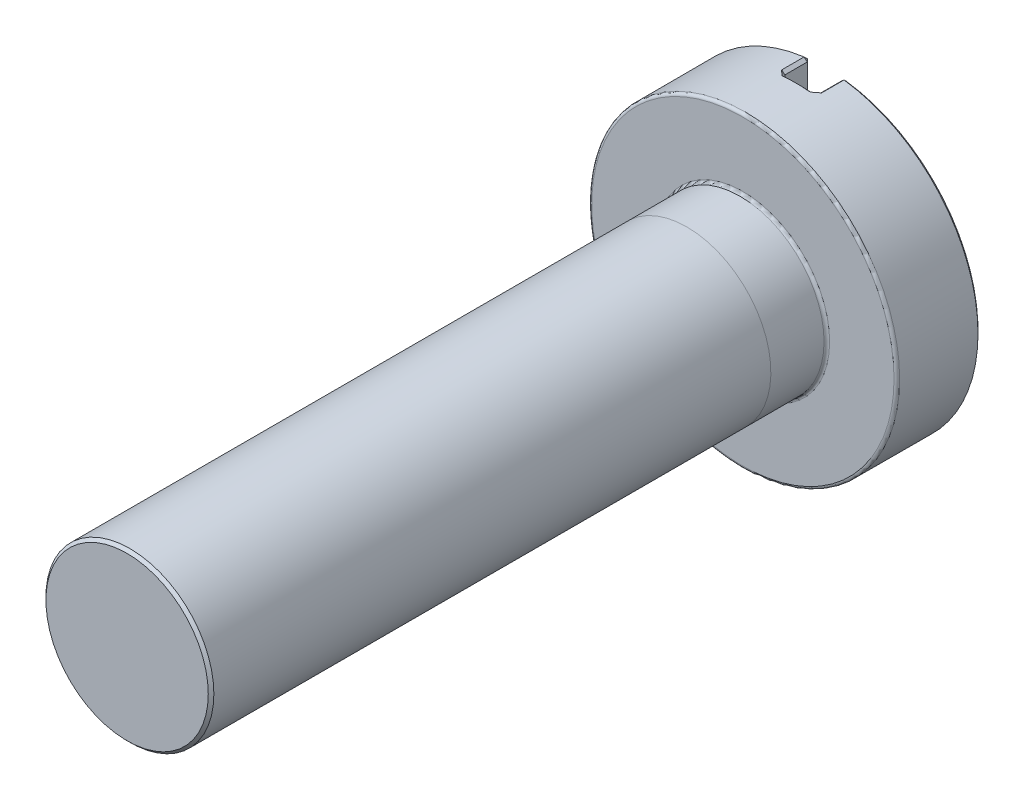
ISO-10303-21;
HEADER;
FILE_DESCRIPTION(('STEP AP214'),'2;1');
FILE_NAME('part.step','',(''),(''),'','','');
FILE_SCHEMA(('AUTOMOTIVE_DESIGN { 1 0 10303 214 1 1 1 1 }'));
ENDSEC;
DATA;
#1=APPLICATION_CONTEXT('core data for automotive mechanical design processes');
#2=APPLICATION_PROTOCOL_DEFINITION('international standard','automotive_design',2000,#1);
#3=PRODUCT_CONTEXT('',#1,'mechanical');
#4=PRODUCT('Part','Part','',(#3));
#5=PRODUCT_RELATED_PRODUCT_CATEGORY('part','',(#4));
#6=PRODUCT_DEFINITION_FORMATION('','',#4);
#7=PRODUCT_DEFINITION_CONTEXT('part definition',#1,'design');
#8=PRODUCT_DEFINITION('design','',#6,#7);
#9=PRODUCT_DEFINITION_SHAPE('','',#8);
#10=(LENGTH_UNIT() NAMED_UNIT(*) SI_UNIT(.MILLI.,.METRE.));
#11=(NAMED_UNIT(*) PLANE_ANGLE_UNIT() SI_UNIT($,.RADIAN.));
#12=(NAMED_UNIT(*) SI_UNIT($,.STERADIAN.) SOLID_ANGLE_UNIT());
#13=UNCERTAINTY_MEASURE_WITH_UNIT(LENGTH_MEASURE(1.E-05),#10,'distance_accuracy_value','');
#14=(GEOMETRIC_REPRESENTATION_CONTEXT(3) GLOBAL_UNCERTAINTY_ASSIGNED_CONTEXT((#13)) GLOBAL_UNIT_ASSIGNED_CONTEXT((#10,
#11,#12)) REPRESENTATION_CONTEXT('',''));
#15=CARTESIAN_POINT('',(0.,0.,0.));
#16=DIRECTION('',(0.,0.,1.));
#17=DIRECTION('',(1.,0.,0.));
#18=AXIS2_PLACEMENT_3D('',#15,#16,#17);
#19=CARTESIAN_POINT('',(0.,0.,11.));
#20=DIRECTION('',(0.,0.,-1.));
#21=DIRECTION('',(-1.,0.,0.));
#22=AXIS2_PLACEMENT_3D('',#19,#20,#21);
#23=CYLINDRICAL_SURFACE('',#22,1.5);
#24=CARTESIAN_POINT('',(0.,0.,10.95));
#25=DIRECTION('',(0.,0.,1.));
#26=DIRECTION('',(1.,0.,0.));
#27=AXIS2_PLACEMENT_3D('',#24,#25,#26);
#28=CIRCLE('',#27,1.5);
#29=CARTESIAN_POINT('',(1.5,0.,10.95));
#30=VERTEX_POINT('',#29);
#31=EDGE_CURVE('E49',#30,#30,#28,.F.);
#32=ORIENTED_EDGE('',*,*,#31,.T.);
#33=EDGE_LOOP('',(#32));
#34=FACE_BOUND('',#33,.T.);
#35=CARTESIAN_POINT('',(0.,0.,0.999999999999999));
#36=DIRECTION('',(0.,0.,-1.));
#37=DIRECTION('',(0.,1.,0.));
#38=AXIS2_PLACEMENT_3D('',#35,#36,#37);
#39=CIRCLE('',#38,1.5);
#40=CARTESIAN_POINT('',(0.,1.5,0.999999999999999));
#41=VERTEX_POINT('',#40);
#42=EDGE_CURVE('E11',#41,#41,#39,.T.);
#43=ORIENTED_EDGE('',*,*,#42,.F.);
#44=EDGE_LOOP('',(#43));
#45=FACE_BOUND('',#44,.T.);
#46=ADVANCED_FACE('F39',(#34,#45),#23,.T.);
#47=CARTESIAN_POINT('',(0.,0.,-1.5));
#48=DIRECTION('',(0.,0.,1.));
#49=DIRECTION('',(1.,0.,0.));
#50=AXIS2_PLACEMENT_3D('',#47,#48,#49);
#51=CYLINDRICAL_SURFACE('',#50,2.75);
#52=CARTESIAN_POINT('',(0.,0.,-0.0499999999999999));
#53=DIRECTION('',(0.,0.,1.));
#54=DIRECTION('',(1.,0.,0.));
#55=AXIS2_PLACEMENT_3D('',#52,#53,#54);
#56=CIRCLE('',#55,2.75);
#57=CARTESIAN_POINT('',(2.75,0.,-0.0499999999999999));
#58=VERTEX_POINT('',#57);
#59=EDGE_CURVE('E506',#58,#58,#56,.F.);
#60=ORIENTED_EDGE('',*,*,#59,.T.);
#61=EDGE_LOOP('',(#60));
#62=FACE_BOUND('',#61,.T.);
#63=CARTESIAN_POINT('',(0.356481481481481,-2.72679683023154,-1.05));
#64=CARTESIAN_POINT('',(0.347664395842464,-2.72794946380014,-1.04117807206455));
#65=CARTESIAN_POINT('',(0.33882512364023,-2.7290615860206,-1.03237298581949));
#66=CARTESIAN_POINT('',(0.321099028338335,-2.73120398569254,-1.01480079977808));
#67=CARTESIAN_POINT('',(0.312212205212935,-2.73223426309969,-1.0060337000023));
#68=CARTESIAN_POINT('',(0.287162841256096,-2.73501387422917,-0.981451563587695));
#69=CARTESIAN_POINT('',(0.270942516358508,-2.73666902458202,-0.965684718089822));
#70=CARTESIAN_POINT('',(0.254629629631047,-2.7381862156752,-0.950000000001396));
#71=B_SPLINE_CURVE_WITH_KNOTS('',3,(#63,#64,#65,#66,#67,#68,#69,#70),.UNSPECIFIED.,.F.,.F.,(4,2,
2,4),(0.,0.0375773794297737,0.0751547792021278,0.1431957218944),.UNSPECIFIED.);
#72=CARTESIAN_POINT('',(0.356481481481481,-2.72679683023154,-1.05));
#73=VERTEX_POINT('',#72);
#74=CARTESIAN_POINT('',(0.254629629629628,-2.73818621567538,-0.95));
#75=VERTEX_POINT('',#74);
#76=EDGE_CURVE('E251',#73,#75,#71,.T.);
#77=ORIENTED_EDGE('',*,*,#76,.F.);
#78=DIRECTION('',(0.,0.,1.));
#79=VECTOR('',#78,1.);
#80=CARTESIAN_POINT('',(0.356481481481481,-2.72679683023154,-1.5));
#81=LINE('',#80,#79);
#82=CARTESIAN_POINT('',(0.356481481481481,-2.72679683023154,-1.45));
#83=VERTEX_POINT('',#82);
#84=EDGE_CURVE('E249',#73,#83,#81,.F.);
#85=ORIENTED_EDGE('',*,*,#84,.T.);
#86=CARTESIAN_POINT('',(0.,0.,-1.45));
#87=DIRECTION('',(0.,0.,1.));
#88=DIRECTION('',(1.,0.,0.));
#89=AXIS2_PLACEMENT_3D('',#86,#87,#88);
#90=CIRCLE('',#89,2.75);
#91=CARTESIAN_POINT('',(0.356481481481483,2.72679683023154,-1.45));
#92=VERTEX_POINT('',#91);
#93=EDGE_CURVE('E245',#83,#92,#90,.T.);
#94=ORIENTED_EDGE('',*,*,#93,.T.);
#95=DIRECTION('',(0.,0.,1.));
#96=VECTOR('',#95,1.);
#97=CARTESIAN_POINT('',(0.356481481481483,2.72679683023154,-1.5));
#98=LINE('',#97,#96);
#99=CARTESIAN_POINT('',(0.356481481481483,2.72679683023154,-1.05));
#100=VERTEX_POINT('',#99);
#101=EDGE_CURVE('E236',#92,#100,#98,.T.);
#102=ORIENTED_EDGE('',*,*,#101,.T.);
#103=CARTESIAN_POINT('',(0.254629629629628,2.73818621567538,-0.95));
#104=CARTESIAN_POINT('',(0.263638943794522,2.73734837041017,-0.958661912495163));
#105=CARTESIAN_POINT('',(0.272619899169562,2.73646840241964,-0.967349125297718));
#106=CARTESIAN_POINT('',(0.290528422567071,2.73462508679492,-0.984769605017457));
#107=CARTESIAN_POINT('',(0.299455990634111,2.73366173923036,-0.99350287189618));
#108=CARTESIAN_POINT('',(0.324478250116621,2.7308381100455,-1.01810769091684));
#109=CARTESIAN_POINT('',(0.340515929031503,2.728883819563,-1.034026548804));
#110=CARTESIAN_POINT('',(0.356481481481483,2.72679683023154,-1.05));
#111=B_SPLINE_CURVE_WITH_KNOTS('',3,(#103,#104,#105,#106,#107,#108,#109,#110),.UNSPECIFIED.,.F.,
.F.,(4,2,2,4),(0.,0.0375774596881583,0.0751548880003336,0.143195791124041),.UNSPECIFIED.);
#112=CARTESIAN_POINT('',(0.254629629629628,2.73818621567538,-0.95));
#113=VERTEX_POINT('',#112);
#114=EDGE_CURVE('E229',#113,#100,#111,.T.);
#115=ORIENTED_EDGE('',*,*,#114,.F.);
#116=CARTESIAN_POINT('',(0.,0.,-0.95));
#117=DIRECTION('',(0.,0.,-1.));
#118=DIRECTION('',(-1.,0.,0.));
#119=AXIS2_PLACEMENT_3D('',#116,#117,#118);
#120=CIRCLE('',#119,2.75);
#121=CARTESIAN_POINT('',(-0.254629629629628,2.73818621567538,-0.95));
#122=VERTEX_POINT('',#121);
#123=EDGE_CURVE('E192',#113,#122,#120,.F.);
#124=ORIENTED_EDGE('',*,*,#123,.T.);
#125=CARTESIAN_POINT('',(-0.356481481481481,2.72679683023154,-1.05));
#126=CARTESIAN_POINT('',(-0.347664395842464,2.72794946380014,-1.04117807206455));
#127=CARTESIAN_POINT('',(-0.33882512364023,2.7290615860206,-1.03237298581949));
#128=CARTESIAN_POINT('',(-0.321099028338336,2.73120398569254,-1.01480079977808));
#129=CARTESIAN_POINT('',(-0.312212205212935,2.73223426309969,-1.0060337000023));
#130=CARTESIAN_POINT('',(-0.287162841256096,2.73501387422917,-0.981451563587695));
#131=CARTESIAN_POINT('',(-0.270942516358508,2.73666902458202,-0.965684718089822));
#132=CARTESIAN_POINT('',(-0.254629629631047,2.7381862156752,-0.950000000001396));
#133=B_SPLINE_CURVE_WITH_KNOTS('',3,(#125,#126,#127,#128,#129,#130,#131,#132),.UNSPECIFIED.,.F.,
.F.,(4,2,2,4),(0.,0.0375773794297736,0.0751547792021278,0.1431957218944),.UNSPECIFIED.);
#134=CARTESIAN_POINT('',(-0.356481481481481,2.72679683023154,-1.05));
#135=VERTEX_POINT('',#134);
#136=EDGE_CURVE('E183',#135,#122,#133,.T.);
#137=ORIENTED_EDGE('',*,*,#136,.F.);
#138=DIRECTION('',(0.,0.,1.));
#139=VECTOR('',#138,1.);
#140=CARTESIAN_POINT('',(-0.356481481481481,2.72679683023154,-1.5));
#141=LINE('',#140,#139);
#142=CARTESIAN_POINT('',(-0.356481481481481,2.72679683023154,-1.45));
#143=VERTEX_POINT('',#142);
#144=EDGE_CURVE('E180',#135,#143,#141,.F.);
#145=ORIENTED_EDGE('',*,*,#144,.T.);
#146=CARTESIAN_POINT('',(0.,0.,-1.45));
#147=DIRECTION('',(0.,0.,1.));
#148=DIRECTION('',(1.,0.,0.));
#149=AXIS2_PLACEMENT_3D('',#146,#147,#148);
#150=CIRCLE('',#149,2.75);
#151=CARTESIAN_POINT('',(-0.356481481481481,-2.72679683023154,-1.45));
#152=VERTEX_POINT('',#151);
#153=EDGE_CURVE('E175',#143,#152,#150,.T.);
#154=ORIENTED_EDGE('',*,*,#153,.T.);
#155=DIRECTION('',(0.,0.,1.));
#156=VECTOR('',#155,1.);
#157=CARTESIAN_POINT('',(-0.356481481481481,-2.72679683023154,-1.5));
#158=LINE('',#157,#156);
#159=CARTESIAN_POINT('',(-0.356481481481481,-2.72679683023154,-1.05));
#160=VERTEX_POINT('',#159);
#161=EDGE_CURVE('E150',#152,#160,#158,.T.);
#162=ORIENTED_EDGE('',*,*,#161,.T.);
#163=CARTESIAN_POINT('',(-0.254629629629628,-2.73818621567538,-0.95));
#164=CARTESIAN_POINT('',(-0.263638943794522,-2.73734837041017,-0.958661912495163));
#165=CARTESIAN_POINT('',(-0.272619899169562,-2.73646840241964,-0.967349125297718));
#166=CARTESIAN_POINT('',(-0.290528422567071,-2.73462508679492,-0.984769605017457));
#167=CARTESIAN_POINT('',(-0.299455990634111,-2.73366173923036,-0.993502871896181));
#168=CARTESIAN_POINT('',(-0.324478250116621,-2.7308381100455,-1.01810769091684));
#169=CARTESIAN_POINT('',(-0.340515929031502,-2.728883819563,-1.034026548804));
#170=CARTESIAN_POINT('',(-0.356481481481481,-2.72679683023154,-1.05));
#171=B_SPLINE_CURVE_WITH_KNOTS('',3,(#163,#164,#165,#166,#167,#168,#169,#170),.UNSPECIFIED.,.F.,
.F.,(4,2,2,4),(0.,0.0375774596881584,0.075154888000334,0.14319579112404),.UNSPECIFIED.);
#172=CARTESIAN_POINT('',(-0.254629629629628,-2.73818621567538,-0.95));
#173=VERTEX_POINT('',#172);
#174=EDGE_CURVE('E238',#173,#160,#171,.T.);
#175=ORIENTED_EDGE('',*,*,#174,.F.);
#176=CARTESIAN_POINT('',(0.,0.,-0.95));
#177=DIRECTION('',(0.,0.,-1.));
#178=DIRECTION('',(-1.,0.,0.));
#179=AXIS2_PLACEMENT_3D('',#176,#177,#178);
#180=CIRCLE('',#179,2.75);
#181=EDGE_CURVE('E247',#173,#75,#180,.F.);
#182=ORIENTED_EDGE('',*,*,#181,.T.);
#183=EDGE_LOOP('',(#77,#85,#94,#102,#115,#124,#137,#145,#154,#162,#175,#182));
#184=FACE_BOUND('',#183,.T.);
#185=ADVANCED_FACE('F194',(#62,#184),#51,.T.);
#186=CARTESIAN_POINT('',(0.,0.,-1.5));
#187=DIRECTION('',(0.,0.,1.));
#188=DIRECTION('',(1.,0.,0.));
#189=AXIS2_PLACEMENT_3D('',#186,#187,#188);
#190=PLANE('',#189);
#191=CARTESIAN_POINT('',(0.,0.,-1.5));
#192=DIRECTION('',(0.,0.,1.));
#193=DIRECTION('',(1.,0.,0.));
#194=AXIS2_PLACEMENT_3D('',#191,#192,#193);
#195=CIRCLE('',#194,2.7);
#196=CARTESIAN_POINT('',(0.35,2.67721870604551,-1.5));
#197=VERTEX_POINT('',#196);
#198=CARTESIAN_POINT('',(0.35,-2.67721870604551,-1.5));
#199=VERTEX_POINT('',#198);
#200=EDGE_CURVE('E551',#197,#199,#195,.F.);
#201=ORIENTED_EDGE('',*,*,#200,.T.);
#202=DIRECTION('',(0.,1.,0.));
#203=VECTOR('',#202,1.);
#204=CARTESIAN_POINT('',(0.35,0.,-1.5));
#205=LINE('',#204,#203);
#206=EDGE_CURVE('E595',#199,#197,#205,.T.);
#207=ORIENTED_EDGE('',*,*,#206,.T.);
#208=EDGE_LOOP('',(#201,#207));
#209=FACE_BOUND('',#208,.T.);
#210=ADVANCED_FACE('F485',(#209),#190,.F.);
#211=ORIENTED_EDGE('',*,*,#42,.T.);
#212=EDGE_LOOP('',(#211));
#213=FACE_BOUND('',#212,.T.);
#214=CARTESIAN_POINT('',(0.,0.,0.0499999999999997));
#215=DIRECTION('',(0.,0.,1.));
#216=DIRECTION('',(1.,0.,0.));
#217=AXIS2_PLACEMENT_3D('',#214,#215,#216);
#218=CIRCLE('',#217,1.5);
#219=CARTESIAN_POINT('',(1.5,0.,0.0499999999999997));
#220=VERTEX_POINT('',#219);
#221=EDGE_CURVE('E504',#220,#220,#218,.T.);
#222=ORIENTED_EDGE('',*,*,#221,.T.);
#223=EDGE_LOOP('',(#222));
#224=FACE_BOUND('',#223,.T.);
#225=ADVANCED_FACE('F207',(#213,#224),#23,.T.);
#226=CARTESIAN_POINT('',(0.,0.,11.));
#227=DIRECTION('',(0.,0.,1.));
#228=DIRECTION('',(1.,0.,0.));
#229=AXIS2_PLACEMENT_3D('',#226,#227,#228);
#230=PLANE('',#229);
#231=CARTESIAN_POINT('',(0.,0.,11.));
#232=DIRECTION('',(0.,0.,1.));
#233=DIRECTION('',(1.,0.,0.));
#234=AXIS2_PLACEMENT_3D('',#231,#232,#233);
#235=CIRCLE('',#234,1.45);
#236=CARTESIAN_POINT('',(1.45,0.,11.));
#237=VERTEX_POINT('',#236);
#238=EDGE_CURVE('E505',#237,#237,#235,.T.);
#239=ORIENTED_EDGE('',*,*,#238,.T.);
#240=EDGE_LOOP('',(#239));
#241=FACE_BOUND('',#240,.T.);
#242=ADVANCED_FACE('F490',(#241),#230,.T.);
#243=CARTESIAN_POINT('',(0.,0.,-1.5));
#244=DIRECTION('',(0.,0.,1.));
#245=DIRECTION('',(1.,0.,0.));
#246=AXIS2_PLACEMENT_3D('',#243,#244,#245);
#247=CIRCLE('',#246,2.7);
#248=CARTESIAN_POINT('',(-0.35,-2.67721870604551,-1.5));
#249=VERTEX_POINT('',#248);
#250=CARTESIAN_POINT('',(-0.35,2.67721870604551,-1.5));
#251=VERTEX_POINT('',#250);
#252=EDGE_CURVE('E55',#249,#251,#247,.F.);
#253=ORIENTED_EDGE('',*,*,#252,.T.);
#254=DIRECTION('',(0.,-1.,0.));
#255=VECTOR('',#254,1.);
#256=CARTESIAN_POINT('',(-0.35,0.,-1.5));
#257=LINE('',#256,#255);
#258=EDGE_CURVE('E522',#251,#249,#257,.T.);
#259=ORIENTED_EDGE('',*,*,#258,.T.);
#260=EDGE_LOOP('',(#253,#259));
#261=FACE_BOUND('',#260,.T.);
#262=ADVANCED_FACE('F496',(#261),#190,.F.);
#263=CARTESIAN_POINT('',(0.,0.,0.));
#264=DIRECTION('',(0.,0.,1.));
#265=DIRECTION('',(1.,0.,0.));
#266=AXIS2_PLACEMENT_3D('',#263,#264,#265);
#267=PLANE('',#266);
#268=CARTESIAN_POINT('',(0.,0.,0.));
#269=DIRECTION('',(0.,0.,1.));
#270=DIRECTION('',(1.,0.,0.));
#271=AXIS2_PLACEMENT_3D('',#268,#269,#270);
#272=CIRCLE('',#271,2.7);
#273=CARTESIAN_POINT('',(2.7,0.,0.));
#274=VERTEX_POINT('',#273);
#275=EDGE_CURVE('E511',#274,#274,#272,.T.);
#276=ORIENTED_EDGE('',*,*,#275,.T.);
#277=EDGE_LOOP('',(#276));
#278=FACE_BOUND('',#277,.T.);
#279=CARTESIAN_POINT('',(0.,0.,0.));
#280=DIRECTION('',(0.,0.,1.));
#281=DIRECTION('',(1.,0.,0.));
#282=AXIS2_PLACEMENT_3D('',#279,#280,#281);
#283=CIRCLE('',#282,1.55);
#284=CARTESIAN_POINT('',(1.55,0.,0.));
#285=VERTEX_POINT('',#284);
#286=EDGE_CURVE('E519',#285,#285,#283,.F.);
#287=ORIENTED_EDGE('',*,*,#286,.T.);
#288=EDGE_LOOP('',(#287));
#289=FACE_BOUND('',#288,.T.);
#290=ADVANCED_FACE('F610',(#278,#289),#267,.T.);
#291=CARTESIAN_POINT('',(0.3,-5.11751622539691,-1.));
#292=DIRECTION('',(1.,0.,0.));
#293=DIRECTION('',(0.,0.,-1.));
#294=AXIS2_PLACEMENT_3D('',#291,#292,#293);
#295=PLANE('',#294);
#296=DIRECTION('',(0.,0.,1.));
#297=VECTOR('',#296,1.);
#298=CARTESIAN_POINT('',(0.3,-2.67721870604551,-1.));
#299=LINE('',#298,#297);
#300=CARTESIAN_POINT('',(0.3,-2.67721870604551,-1.45));
#301=VERTEX_POINT('',#300);
#302=CARTESIAN_POINT('',(0.3,-2.67721870604551,-1.05));
#303=VERTEX_POINT('',#302);
#304=EDGE_CURVE('E547',#301,#303,#299,.T.);
#305=ORIENTED_EDGE('',*,*,#304,.T.);
#306=DIRECTION('',(0.,1.,0.));
#307=VECTOR('',#306,1.);
#308=CARTESIAN_POINT('',(0.3,-5.11751622539691,-1.05));
#309=LINE('',#308,#307);
#310=CARTESIAN_POINT('',(0.3,2.67721870604551,-1.05));
#311=VERTEX_POINT('',#310);
#312=EDGE_CURVE('E865',#303,#311,#309,.T.);
#313=ORIENTED_EDGE('',*,*,#312,.T.);
#314=DIRECTION('',(0.,0.,-1.));
#315=VECTOR('',#314,1.);
#316=CARTESIAN_POINT('',(0.3,2.67721870604551,-1.5));
#317=LINE('',#316,#315);
#318=CARTESIAN_POINT('',(0.3,2.67721870604551,-1.45));
#319=VERTEX_POINT('',#318);
#320=EDGE_CURVE('E868',#311,#319,#317,.T.);
#321=ORIENTED_EDGE('',*,*,#320,.T.);
#322=DIRECTION('',(0.,-1.,0.));
#323=VECTOR('',#322,1.);
#324=CARTESIAN_POINT('',(0.3,-5.11751622539691,-1.45));
#325=LINE('',#324,#323);
#326=EDGE_CURVE('E258',#319,#301,#325,.T.);
#327=ORIENTED_EDGE('',*,*,#326,.T.);
#328=EDGE_LOOP('',(#305,#313,#321,#327));
#329=FACE_BOUND('',#328,.T.);
#330=ADVANCED_FACE('F614',(#329),#295,.F.);
#331=CARTESIAN_POINT('',(-0.3,-5.11751622539691,-1.));
#332=DIRECTION('',(-1.,0.,0.));
#333=DIRECTION('',(0.,0.,1.));
#334=AXIS2_PLACEMENT_3D('',#331,#332,#333);
#335=PLANE('',#334);
#336=DIRECTION('',(0.,0.,1.));
#337=VECTOR('',#336,1.);
#338=CARTESIAN_POINT('',(-0.3,2.67721870604551,-1.));
#339=LINE('',#338,#337);
#340=CARTESIAN_POINT('',(-0.3,2.67721870604551,-1.45));
#341=VERTEX_POINT('',#340);
#342=CARTESIAN_POINT('',(-0.3,2.67721870604551,-1.05));
#343=VERTEX_POINT('',#342);
#344=EDGE_CURVE('E167',#341,#343,#339,.T.);
#345=ORIENTED_EDGE('',*,*,#344,.T.);
#346=DIRECTION('',(0.,-1.,0.));
#347=VECTOR('',#346,1.);
#348=CARTESIAN_POINT('',(-0.3,-5.11751622539691,-1.05));
#349=LINE('',#348,#347);
#350=CARTESIAN_POINT('',(-0.3,-2.67721870604551,-1.05));
#351=VERTEX_POINT('',#350);
#352=EDGE_CURVE('E172',#343,#351,#349,.T.);
#353=ORIENTED_EDGE('',*,*,#352,.T.);
#354=DIRECTION('',(0.,0.,-1.));
#355=VECTOR('',#354,1.);
#356=CARTESIAN_POINT('',(-0.3,-2.67721870604551,-1.5));
#357=LINE('',#356,#355);
#358=CARTESIAN_POINT('',(-0.3,-2.67721870604551,-1.45));
#359=VERTEX_POINT('',#358);
#360=EDGE_CURVE('E148',#351,#359,#357,.T.);
#361=ORIENTED_EDGE('',*,*,#360,.T.);
#362=DIRECTION('',(0.,1.,0.));
#363=VECTOR('',#362,1.);
#364=CARTESIAN_POINT('',(-0.3,-5.11751622539691,-1.45));
#365=LINE('',#364,#363);
#366=EDGE_CURVE('E161',#359,#341,#365,.T.);
#367=ORIENTED_EDGE('',*,*,#366,.T.);
#368=EDGE_LOOP('',(#345,#353,#361,#367));
#369=FACE_BOUND('',#368,.T.);
#370=ADVANCED_FACE('F170',(#369),#335,.F.);
#371=CARTESIAN_POINT('',(0.,0.,-1.));
#372=DIRECTION('',(0.,0.,-1.));
#373=DIRECTION('',(-1.,0.,0.));
#374=AXIS2_PLACEMENT_3D('',#371,#372,#373);
#375=PLANE('',#374);
#376=DIRECTION('',(0.,-1.,0.));
#377=VECTOR('',#376,1.);
#378=CARTESIAN_POINT('',(0.249999999999999,0.,-1.));
#379=LINE('',#378,#377);
#380=CARTESIAN_POINT('',(0.249999999999998,2.68840101175401,-1.));
#381=VERTEX_POINT('',#380);
#382=CARTESIAN_POINT('',(0.249999999999999,-2.68840101175401,-1.));
#383=VERTEX_POINT('',#382);
#384=EDGE_CURVE('E586',#381,#383,#379,.T.);
#385=ORIENTED_EDGE('',*,*,#384,.T.);
#386=CARTESIAN_POINT('',(0.,0.,-1.));
#387=DIRECTION('',(0.,0.,-1.));
#388=DIRECTION('',(-1.,0.,0.));
#389=AXIS2_PLACEMENT_3D('',#386,#387,#388);
#390=CIRCLE('',#389,2.7);
#391=CARTESIAN_POINT('',(-0.249999999999999,-2.68840101175401,-1.));
#392=VERTEX_POINT('',#391);
#393=EDGE_CURVE('E565',#383,#392,#390,.T.);
#394=ORIENTED_EDGE('',*,*,#393,.T.);
#395=DIRECTION('',(0.,1.,0.));
#396=VECTOR('',#395,1.);
#397=CARTESIAN_POINT('',(-0.249999999999999,0.,-1.));
#398=LINE('',#397,#396);
#399=CARTESIAN_POINT('',(-0.249999999999999,2.68840101175401,-1.));
#400=VERTEX_POINT('',#399);
#401=EDGE_CURVE('E590',#392,#400,#398,.T.);
#402=ORIENTED_EDGE('',*,*,#401,.T.);
#403=CARTESIAN_POINT('',(0.,0.,-1.));
#404=DIRECTION('',(0.,0.,-1.));
#405=DIRECTION('',(-1.,0.,0.));
#406=AXIS2_PLACEMENT_3D('',#403,#404,#405);
#407=CIRCLE('',#406,2.7);
#408=EDGE_CURVE('E583',#400,#381,#407,.T.);
#409=ORIENTED_EDGE('',*,*,#408,.T.);
#410=EDGE_LOOP('',(#385,#394,#402,#409));
#411=FACE_BOUND('',#410,.T.);
#412=ADVANCED_FACE('F467',(#411),#375,.T.);
#413=CARTESIAN_POINT('',(0.3,2.67721870604551,-1.45));
#414=DIRECTION('',(-0.550659428732135,0.62733435032428,-0.550659428732145));
#415=DIRECTION('',(0.,0.659685671502101,0.751541625470488));
#416=AXIS2_PLACEMENT_3D('',#413,#414,#415);
#417=PLANE('',#416);
#418=DIRECTION('',(0.751541625470493,0.659685671502094,0.));
#419=VECTOR('',#418,1.);
#420=CARTESIAN_POINT('',(0.3,2.67721870604551,-1.45));
#421=LINE('',#420,#419);
#422=EDGE_CURVE('E528',#92,#319,#421,.F.);
#423=ORIENTED_EDGE('',*,*,#422,.F.);
#424=DIRECTION('',(-0.0916619901538359,-0.701140556208987,-0.707106781186542));
#425=VECTOR('',#424,1.);
#426=CARTESIAN_POINT('',(0.,0.,-4.19999999999998));
#427=LINE('',#426,#425);
#428=EDGE_CURVE('E168',#197,#92,#427,.F.);
#429=ORIENTED_EDGE('',*,*,#428,.F.);
#430=DIRECTION('',(0.707106781186554,0.,-0.707106781186541));
#431=VECTOR('',#430,1.);
#432=CARTESIAN_POINT('',(0.3,2.67721870604551,-1.45));
#433=LINE('',#432,#431);
#434=EDGE_CURVE('E525',#319,#197,#433,.T.);
#435=ORIENTED_EDGE('',*,*,#434,.F.);
#436=EDGE_LOOP('',(#423,#429,#435));
#437=FACE_BOUND('',#436,.T.);
#438=ADVANCED_FACE('F461',(#437),#417,.T.);
#439=CARTESIAN_POINT('',(0.,0.,-1.45));
#440=DIRECTION('',(0.,0.,1.));
#441=DIRECTION('',(1.,0.,0.));
#442=AXIS2_PLACEMENT_3D('',#439,#440,#441);
#443=CONICAL_SURFACE('',#442,2.75,0.785398163397457);
#444=ORIENTED_EDGE('',*,*,#428,.T.);
#445=ORIENTED_EDGE('',*,*,#93,.F.);
#446=DIRECTION('',(0.0916619901538104,-0.70114055620899,0.707106781186541));
#447=VECTOR('',#446,1.);
#448=CARTESIAN_POINT('',(0.,0.,-4.19999999999995));
#449=LINE('',#448,#447);
#450=EDGE_CURVE('E531',#199,#83,#449,.T.);
#451=ORIENTED_EDGE('',*,*,#450,.F.);
#452=ORIENTED_EDGE('',*,*,#200,.F.);
#453=EDGE_LOOP('',(#444,#445,#451,#452));
#454=FACE_BOUND('',#453,.T.);
#455=ADVANCED_FACE('F455',(#454),#443,.T.);
#456=CARTESIAN_POINT('',(0.35,0.,-1.5));
#457=DIRECTION('',(0.707106781186541,0.,0.707106781186554));
#458=DIRECTION('',(0.,1.,0.));
#459=AXIS2_PLACEMENT_3D('',#456,#457,#458);
#460=PLANE('',#459);
#461=ORIENTED_EDGE('',*,*,#434,.T.);
#462=ORIENTED_EDGE('',*,*,#206,.F.);
#463=DIRECTION('',(-0.707106781186554,0.,0.707106781186541));
#464=VECTOR('',#463,1.);
#465=CARTESIAN_POINT('',(0.328240740740742,-2.67721870604551,-1.47824074074074));
#466=LINE('',#465,#464);
#467=EDGE_CURVE('E534',#301,#199,#466,.F.);
#468=ORIENTED_EDGE('',*,*,#467,.F.);
#469=ORIENTED_EDGE('',*,*,#326,.F.);
#470=EDGE_LOOP('',(#461,#462,#468,#469));
#471=FACE_BOUND('',#470,.T.);
#472=ADVANCED_FACE('F448',(#471),#460,.F.);
#473=CARTESIAN_POINT('',(0.3,2.67721870604551,-1.5));
#474=DIRECTION('',(-0.659685671502094,0.751541625470493,0.));
#475=DIRECTION('',(0.,0.,1.));
#476=AXIS2_PLACEMENT_3D('',#473,#474,#475);
#477=PLANE('',#476);
#478=ORIENTED_EDGE('',*,*,#422,.T.);
#479=ORIENTED_EDGE('',*,*,#320,.F.);
#480=DIRECTION('',(-0.751541625470493,-0.659685671502094,0.));
#481=VECTOR('',#480,1.);
#482=CARTESIAN_POINT('',(0.356481481481483,2.72679683023154,-1.05));
#483=LINE('',#482,#481);
#484=EDGE_CURVE('E536',#100,#311,#483,.T.);
#485=ORIENTED_EDGE('',*,*,#484,.F.);
#486=ORIENTED_EDGE('',*,*,#101,.F.);
#487=EDGE_LOOP('',(#478,#479,#485,#486));
#488=FACE_BOUND('',#487,.T.);
#489=ADVANCED_FACE('F441',(#488),#477,.T.);
#490=CARTESIAN_POINT('',(0.356481481481481,-2.72679683023154,-1.45));
#491=DIRECTION('',(-0.550659428732158,-0.62733435032426,-0.550659428732145));
#492=DIRECTION('',(0.75154162547047,-0.659685671502121,0.));
#493=AXIS2_PLACEMENT_3D('',#490,#491,#492);
#494=PLANE('',#493);
#495=ORIENTED_EDGE('',*,*,#467,.T.);
#496=ORIENTED_EDGE('',*,*,#450,.T.);
#497=DIRECTION('',(0.75154162547047,-0.65968567150212,0.));
#498=VECTOR('',#497,1.);
#499=CARTESIAN_POINT('',(0.356481481481481,-2.72679683023154,-1.45));
#500=LINE('',#499,#498);
#501=EDGE_CURVE('E396',#301,#83,#500,.T.);
#502=ORIENTED_EDGE('',*,*,#501,.F.);
#503=EDGE_LOOP('',(#495,#496,#502));
#504=FACE_BOUND('',#503,.T.);
#505=ADVANCED_FACE('F429',(#504),#494,.T.);
#506=CARTESIAN_POINT('',(0.249999999999998,2.68840101175401,-1.));
#507=CARTESIAN_POINT('',(0.3,2.67721870604551,-1.05));
#508=CARTESIAN_POINT('',(0.254629629629628,2.73818621567538,-0.95));
#509=CARTESIAN_POINT('',(0.356481481481483,2.72679683023154,-1.05));
#510=CARTESIAN_POINT('',(0.254700493957951,2.73894826260323,-0.949234665254112));
#511=CARTESIAN_POINT('',(0.357346026287023,2.72755570745305,-1.05));
#512=B_SPLINE_SURFACE_WITH_KNOTS('',1,1,((#506,#507),(#508,#509),(#510,#511)),.UNSPECIFIED.,.F.,
.F.,.F.,(2,1,2),(2,2),(0.,1.,1.01530669491777),(0.,1.),.UNSPECIFIED.);
#513=CARTESIAN_POINT('',(0.3,2.67721870604551,-1.05));
#514=CARTESIAN_POINT('',(0.295625856762105,2.67819696618349,-1.0456258567621));
#515=CARTESIAN_POINT('',(0.291251713524209,2.67917522632147,-1.04125171352421));
#516=CARTESIAN_POINT('',(0.282503427048418,2.68113174659742,-1.03250342704842));
#517=CARTESIAN_POINT('',(0.278129283810523,2.6821100067354,-1.02812928381052));
#518=CARTESIAN_POINT('',(0.265836760381751,2.68485918183359,-1.01583676038175));
#519=CARTESIAN_POINT('',(0.257918380190875,2.6866300967938,-1.00791838019088));
#520=CARTESIAN_POINT('',(0.249999999999998,2.68840101175401,-1.));
#521=B_SPLINE_CURVE_WITH_KNOTS('',3,(#513,#514,#515,#516,#517,#518,#519,#520),.UNSPECIFIED.,.F.,
.F.,(4,2,2,4),(0.,0.0187885406367622,0.0375770812735245,0.0715894123523757),.UNSPECIFIED.);
#522=EDGE_CURVE('E387',#381,#311,#521,.F.);
#523=DIRECTION('',(0.0654728501098666,0.704069105911138,0.707106781186535));
#524=VECTOR('',#523,1.);
#525=CARTESIAN_POINT('',(0.249999999999998,2.68840101175401,-1.));
#526=LINE('',#525,#524);
#527=EDGE_CURVE('E397',#113,#381,#526,.F.);
#528=ORIENTED_EDGE('',*,*,#114,.T.);
#529=ORIENTED_EDGE('',*,*,#484,.T.);
#530=ORIENTED_EDGE('',*,*,#522,.F.);
#531=ORIENTED_EDGE('',*,*,#527,.F.);
#532=EDGE_LOOP('',(#528,#529,#530,#531));
#533=FACE_BOUND('',#532,.T.);
#534=ADVANCED_FACE('F420',(#533),#512,.T.);
#535=CARTESIAN_POINT('',(0.3,-2.67721870604551,-1.5));
#536=DIRECTION('',(0.65968567150212,0.75154162547047,0.));
#537=DIRECTION('',(0.,0.,1.));
#538=AXIS2_PLACEMENT_3D('',#535,#536,#537);
#539=PLANE('',#538);
#540=ORIENTED_EDGE('',*,*,#501,.T.);
#541=ORIENTED_EDGE('',*,*,#84,.F.);
#542=DIRECTION('',(0.75154162547047,-0.659685671502121,0.));
#543=VECTOR('',#542,1.);
#544=CARTESIAN_POINT('',(0.3,-2.67721870604551,-1.05));
#545=LINE('',#544,#543);
#546=EDGE_CURVE('E561',#303,#73,#545,.T.);
#547=ORIENTED_EDGE('',*,*,#546,.F.);
#548=ORIENTED_EDGE('',*,*,#304,.F.);
#549=EDGE_LOOP('',(#540,#541,#547,#548));
#550=FACE_BOUND('',#549,.T.);
#551=ADVANCED_FACE('F371',(#550),#539,.F.);
#552=CARTESIAN_POINT('',(0.249999999999999,0.,-1.));
#553=DIRECTION('',(0.707106781186535,0.,0.70710678118656));
#554=DIRECTION('',(0.,-1.,0.));
#555=AXIS2_PLACEMENT_3D('',#552,#553,#554);
#556=PLANE('',#555);
#557=ORIENTED_EDGE('',*,*,#522,.T.);
#558=ORIENTED_EDGE('',*,*,#312,.F.);
#559=CARTESIAN_POINT('',(0.249999999999999,-2.68840101175401,-1.));
#560=CARTESIAN_POINT('',(0.254374143237894,-2.68742275161603,-1.0043741432379));
#561=CARTESIAN_POINT('',(0.258748286475789,-2.68644449147805,-1.00874828647579));
#562=CARTESIAN_POINT('',(0.26749657295158,-2.6844879712021,-1.01749657295158));
#563=CARTESIAN_POINT('',(0.271870716189475,-2.68350971106412,-1.02187071618948));
#564=CARTESIAN_POINT('',(0.284163239618247,-2.68076053596593,-1.03416323961825));
#565=CARTESIAN_POINT('',(0.292081619809123,-2.67898962100572,-1.04208161980912));
#566=CARTESIAN_POINT('',(0.3,-2.67721870604551,-1.05));
#567=B_SPLINE_CURVE_WITH_KNOTS('',3,(#559,#560,#561,#562,#563,#564,#565,#566),.UNSPECIFIED.,.F.,
.F.,(4,2,2,4),(0.,0.0187885406367623,0.0375770812735245,0.0715894123523759),.UNSPECIFIED.);
#568=EDGE_CURVE('E379',#383,#303,#567,.T.);
#569=ORIENTED_EDGE('',*,*,#568,.F.);
#570=ORIENTED_EDGE('',*,*,#384,.F.);
#571=EDGE_LOOP('',(#557,#558,#569,#570));
#572=FACE_BOUND('',#571,.T.);
#573=ADVANCED_FACE('F358',(#572),#556,.F.);
#574=CARTESIAN_POINT('',(0.,0.,-0.95));
#575=DIRECTION('',(0.,0.,1.));
#576=DIRECTION('',(1.,0.,0.));
#577=AXIS2_PLACEMENT_3D('',#574,#575,#576);
#578=CONICAL_SURFACE('',#577,2.75,0.785398163397466);
#579=ORIENTED_EDGE('',*,*,#527,.T.);
#580=ORIENTED_EDGE('',*,*,#408,.F.);
#581=DIRECTION('',(0.0654728501098666,-0.704069105911138,-0.707106781186535));
#582=VECTOR('',#581,1.);
#583=CARTESIAN_POINT('',(-0.254629629629628,2.73818621567538,-0.95));
#584=LINE('',#583,#582);
#585=EDGE_CURVE('E572',#122,#400,#584,.T.);
#586=ORIENTED_EDGE('',*,*,#585,.F.);
#587=ORIENTED_EDGE('',*,*,#123,.F.);
#588=EDGE_LOOP('',(#579,#580,#586,#587));
#589=FACE_BOUND('',#588,.T.);
#590=ADVANCED_FACE('F370',(#589),#578,.T.);
#591=CARTESIAN_POINT('',(-0.3,2.67721870604551,-1.5));
#592=DIRECTION('',(-0.65968567150212,-0.75154162547047,0.));
#593=DIRECTION('',(0.,0.,1.));
#594=AXIS2_PLACEMENT_3D('',#591,#592,#593);
#595=PLANE('',#594);
#596=DIRECTION('',(-0.75154162547047,0.65968567150212,0.));
#597=VECTOR('',#596,1.);
#598=CARTESIAN_POINT('',(-0.356481481481481,2.72679683023154,-1.45));
#599=LINE('',#598,#597);
#600=EDGE_CURVE('E566',#143,#341,#599,.F.);
#601=ORIENTED_EDGE('',*,*,#600,.F.);
#602=ORIENTED_EDGE('',*,*,#144,.F.);
#603=DIRECTION('',(-0.75154162547047,0.659685671502121,0.));
#604=VECTOR('',#603,1.);
#605=CARTESIAN_POINT('',(-0.3,2.67721870604551,-1.05));
#606=LINE('',#605,#604);
#607=EDGE_CURVE('E568',#343,#135,#606,.T.);
#608=ORIENTED_EDGE('',*,*,#607,.F.);
#609=ORIENTED_EDGE('',*,*,#344,.F.);
#610=EDGE_LOOP('',(#601,#602,#608,#609));
#611=FACE_BOUND('',#610,.T.);
#612=ADVANCED_FACE('F665',(#611),#595,.F.);
#613=CARTESIAN_POINT('',(0.3,-2.67721870604551,-1.05));
#614=CARTESIAN_POINT('',(0.249999999999998,-2.68840101175401,-1.));
#615=CARTESIAN_POINT('',(0.356481481481481,-2.72679683023154,-1.05));
#616=CARTESIAN_POINT('',(0.254629629629628,-2.73818621567538,-0.95));
#617=CARTESIAN_POINT('',(0.357338228851051,-2.72754886304602,-1.05));
#618=CARTESIAN_POINT('',(0.254699854823855,-2.73894138960823,-0.949241567902348));
#619=B_SPLINE_SURFACE_WITH_KNOTS('',1,1,((#613,#614),(#615,#616),(#617,#618)),.UNSPECIFIED.,.F.,
.F.,.F.,(2,1,2),(2,2),(0.,1.,1.01516864195305),(0.,1.),.UNSPECIFIED.);
#620=DIRECTION('',(-0.0654728501098666,0.704069105911138,-0.707106781186535));
#621=VECTOR('',#620,1.);
#622=CARTESIAN_POINT('',(0.254629629629628,-2.73818621567538,-0.95));
#623=LINE('',#622,#621);
#624=EDGE_CURVE('E316',#383,#75,#623,.F.);
#625=ORIENTED_EDGE('',*,*,#546,.T.);
#626=ORIENTED_EDGE('',*,*,#76,.T.);
#627=ORIENTED_EDGE('',*,*,#624,.F.);
#628=ORIENTED_EDGE('',*,*,#568,.T.);
#629=EDGE_LOOP('',(#625,#626,#627,#628));
#630=FACE_BOUND('',#629,.T.);
#631=ADVANCED_FACE('F356',(#630),#619,.T.);
#632=CARTESIAN_POINT('',(-0.3,2.67721870604551,-1.05));
#633=CARTESIAN_POINT('',(-0.249999999999999,2.68840101175401,-1.));
#634=CARTESIAN_POINT('',(-0.356481481481481,2.72679683023154,-1.05));
#635=CARTESIAN_POINT('',(-0.254629629629628,2.73818621567538,-0.95));
#636=CARTESIAN_POINT('',(-0.357338228851052,2.72754886304602,-1.05));
#637=CARTESIAN_POINT('',(-0.254699854823855,2.73894138960823,-0.949241567902348));
#638=B_SPLINE_SURFACE_WITH_KNOTS('',1,1,((#632,#633),(#634,#635),(#636,#637)),.UNSPECIFIED.,.F.,
.F.,.F.,(2,1,2),(2,2),(0.,1.,1.01516864195305),(0.,1.),.UNSPECIFIED.);
#639=CARTESIAN_POINT('',(-0.249999999999999,2.68840101175401,-1.));
#640=CARTESIAN_POINT('',(-0.254374143237894,2.68742275161603,-1.0043741432379));
#641=CARTESIAN_POINT('',(-0.258748286475789,2.68644449147805,-1.00874828647579));
#642=CARTESIAN_POINT('',(-0.26749657295158,2.6844879712021,-1.01749657295158));
#643=CARTESIAN_POINT('',(-0.271870716189475,2.68350971106412,-1.02187071618948));
#644=CARTESIAN_POINT('',(-0.284163239618247,2.68076053596593,-1.03416323961825));
#645=CARTESIAN_POINT('',(-0.292081619809124,2.67898962100572,-1.04208161980912));
#646=CARTESIAN_POINT('',(-0.3,2.67721870604551,-1.05));
#647=B_SPLINE_CURVE_WITH_KNOTS('',3,(#639,#640,#641,#642,#643,#644,#645,#646),.UNSPECIFIED.,.F.,
.F.,(4,2,2,4),(0.,0.0187885406367623,0.0375770812735245,0.0715894123523759),.UNSPECIFIED.);
#648=EDGE_CURVE('E307',#343,#400,#647,.F.);
#649=ORIENTED_EDGE('',*,*,#136,.T.);
#650=ORIENTED_EDGE('',*,*,#585,.T.);
#651=ORIENTED_EDGE('',*,*,#648,.F.);
#652=ORIENTED_EDGE('',*,*,#607,.T.);
#653=EDGE_LOOP('',(#649,#650,#651,#652));
#654=FACE_BOUND('',#653,.T.);
#655=ADVANCED_FACE('F347',(#654),#638,.T.);
#656=CARTESIAN_POINT('',(-0.356481481481481,2.72679683023154,-1.45));
#657=DIRECTION('',(0.550659428732158,0.62733435032426,-0.550659428732145));
#658=DIRECTION('',(-0.75154162547047,0.659685671502121,0.));
#659=AXIS2_PLACEMENT_3D('',#656,#657,#658);
#660=PLANE('',#659);
#661=DIRECTION('',(-0.0916619901538104,0.70114055620899,0.707106781186541));
#662=VECTOR('',#661,1.);
#663=CARTESIAN_POINT('',(0.,0.,-4.19999999999995));
#664=LINE('',#663,#662);
#665=EDGE_CURVE('E608',#143,#251,#664,.F.);
#666=ORIENTED_EDGE('',*,*,#665,.F.);
#667=ORIENTED_EDGE('',*,*,#600,.T.);
#668=DIRECTION('',(0.707106781186554,0.,0.707106781186541));
#669=VECTOR('',#668,1.);
#670=CARTESIAN_POINT('',(-0.328240740740742,2.67721870604551,-1.47824074074074));
#671=LINE('',#670,#669);
#672=EDGE_CURVE('E164',#251,#341,#671,.T.);
#673=ORIENTED_EDGE('',*,*,#672,.F.);
#674=EDGE_LOOP('',(#666,#667,#673));
#675=FACE_BOUND('',#674,.T.);
#676=ADVANCED_FACE('F340',(#675),#660,.T.);
#677=CARTESIAN_POINT('',(0.,0.,-0.95));
#678=DIRECTION('',(0.,0.,1.));
#679=DIRECTION('',(1.,0.,0.));
#680=AXIS2_PLACEMENT_3D('',#677,#678,#679);
#681=CONICAL_SURFACE('',#680,2.75,0.785398163397466);
#682=ORIENTED_EDGE('',*,*,#624,.T.);
#683=ORIENTED_EDGE('',*,*,#181,.F.);
#684=DIRECTION('',(-0.0654728501098666,-0.704069105911138,0.707106781186535));
#685=VECTOR('',#684,1.);
#686=CARTESIAN_POINT('',(-0.249999999999999,-2.68840101175401,-1.));
#687=LINE('',#686,#685);
#688=EDGE_CURVE('E603',#392,#173,#687,.T.);
#689=ORIENTED_EDGE('',*,*,#688,.F.);
#690=ORIENTED_EDGE('',*,*,#393,.F.);
#691=EDGE_LOOP('',(#682,#683,#689,#690));
#692=FACE_BOUND('',#691,.T.);
#693=ADVANCED_FACE('F293',(#692),#681,.T.);
#694=CARTESIAN_POINT('',(-0.249999999999999,0.,-1.));
#695=DIRECTION('',(-0.707106781186535,0.,0.70710678118656));
#696=DIRECTION('',(0.,1.,0.));
#697=AXIS2_PLACEMENT_3D('',#694,#695,#696);
#698=PLANE('',#697);
#699=ORIENTED_EDGE('',*,*,#648,.T.);
#700=ORIENTED_EDGE('',*,*,#401,.F.);
#701=CARTESIAN_POINT('',(-0.3,-2.67721870604551,-1.05));
#702=CARTESIAN_POINT('',(-0.295625856762105,-2.67819696618349,-1.0456258567621));
#703=CARTESIAN_POINT('',(-0.291251713524209,-2.67917522632147,-1.04125171352421));
#704=CARTESIAN_POINT('',(-0.282503427048419,-2.68113174659742,-1.03250342704842));
#705=CARTESIAN_POINT('',(-0.278129283810523,-2.6821100067354,-1.02812928381052));
#706=CARTESIAN_POINT('',(-0.265836760381751,-2.68485918183359,-1.01583676038175));
#707=CARTESIAN_POINT('',(-0.257918380190875,-2.6866300967938,-1.00791838019088));
#708=CARTESIAN_POINT('',(-0.249999999999999,-2.68840101175401,-1.));
#709=B_SPLINE_CURVE_WITH_KNOTS('',3,(#701,#702,#703,#704,#705,#706,#707,#708),.UNSPECIFIED.,.F.,
.F.,(4,2,2,4),(0.,0.0187885406367623,0.0375770812735247,0.071589412352376),.UNSPECIFIED.);
#710=EDGE_CURVE('E158',#351,#392,#709,.T.);
#711=ORIENTED_EDGE('',*,*,#710,.F.);
#712=ORIENTED_EDGE('',*,*,#352,.F.);
#713=EDGE_LOOP('',(#699,#700,#711,#712));
#714=FACE_BOUND('',#713,.T.);
#715=ADVANCED_FACE('F286',(#714),#698,.F.);
#716=CARTESIAN_POINT('',(-0.35,0.,-1.5));
#717=DIRECTION('',(-0.707106781186541,0.,0.707106781186554));
#718=DIRECTION('',(0.,-1.,0.));
#719=AXIS2_PLACEMENT_3D('',#716,#717,#718);
#720=PLANE('',#719);
#721=ORIENTED_EDGE('',*,*,#672,.T.);
#722=ORIENTED_EDGE('',*,*,#366,.F.);
#723=DIRECTION('',(-0.707106781186554,0.,-0.707106781186541));
#724=VECTOR('',#723,1.);
#725=CARTESIAN_POINT('',(-0.3,-2.67721870604551,-1.45));
#726=LINE('',#725,#724);
#727=EDGE_CURVE('E153',#249,#359,#726,.F.);
#728=ORIENTED_EDGE('',*,*,#727,.F.);
#729=ORIENTED_EDGE('',*,*,#258,.F.);
#730=EDGE_LOOP('',(#721,#722,#728,#729));
#731=FACE_BOUND('',#730,.T.);
#732=ADVANCED_FACE('F162',(#731),#720,.F.);
#733=CARTESIAN_POINT('',(0.,0.,-1.45));
#734=DIRECTION('',(0.,0.,1.));
#735=DIRECTION('',(1.,0.,0.));
#736=AXIS2_PLACEMENT_3D('',#733,#734,#735);
#737=CONICAL_SURFACE('',#736,2.75,0.785398163397457);
#738=ORIENTED_EDGE('',*,*,#665,.T.);
#739=ORIENTED_EDGE('',*,*,#252,.F.);
#740=DIRECTION('',(0.0916619901538104,0.70114055620899,-0.707106781186541));
#741=VECTOR('',#740,1.);
#742=CARTESIAN_POINT('',(0.,0.,-4.19999999999995));
#743=LINE('',#742,#741);
#744=EDGE_CURVE('E63',#152,#249,#743,.T.);
#745=ORIENTED_EDGE('',*,*,#744,.F.);
#746=ORIENTED_EDGE('',*,*,#153,.F.);
#747=EDGE_LOOP('',(#738,#739,#745,#746));
#748=FACE_BOUND('',#747,.T.);
#749=ADVANCED_FACE('F607',(#748),#737,.T.);
#750=CARTESIAN_POINT('',(-0.249999999999999,-2.68840101175401,-1.));
#751=CARTESIAN_POINT('',(-0.3,-2.67721870604551,-1.05));
#752=CARTESIAN_POINT('',(-0.254629629629628,-2.73818621567538,-0.95));
#753=CARTESIAN_POINT('',(-0.356481481481481,-2.72679683023154,-1.05));
#754=CARTESIAN_POINT('',(-0.254700493957951,-2.73894826260323,-0.949234665254112));
#755=CARTESIAN_POINT('',(-0.357346026287021,-2.72755570745305,-1.05));
#756=B_SPLINE_SURFACE_WITH_KNOTS('',1,1,((#750,#751),(#752,#753),(#754,#755)),.UNSPECIFIED.,.F.,
.F.,.F.,(2,1,2),(2,2),(0.,1.,1.01530669491776),(0.,1.),.UNSPECIFIED.);
#757=DIRECTION('',(0.75154162547047,0.659685671502121,0.));
#758=VECTOR('',#757,1.);
#759=CARTESIAN_POINT('',(-0.356481481481481,-2.72679683023154,-1.05));
#760=LINE('',#759,#758);
#761=EDGE_CURVE('E151',#351,#160,#760,.F.);
#762=ORIENTED_EDGE('',*,*,#688,.T.);
#763=ORIENTED_EDGE('',*,*,#174,.T.);
#764=ORIENTED_EDGE('',*,*,#761,.F.);
#765=ORIENTED_EDGE('',*,*,#710,.T.);
#766=EDGE_LOOP('',(#762,#763,#764,#765));
#767=FACE_BOUND('',#766,.T.);
#768=ADVANCED_FACE('F285',(#767),#756,.T.);
#769=CARTESIAN_POINT('',(-0.3,-2.67721870604551,-1.45));
#770=DIRECTION('',(0.550659428732158,-0.62733435032426,-0.550659428732145));
#771=DIRECTION('',(0.75154162547047,0.659685671502121,0.));
#772=AXIS2_PLACEMENT_3D('',#769,#770,#771);
#773=PLANE('',#772);
#774=ORIENTED_EDGE('',*,*,#744,.T.);
#775=ORIENTED_EDGE('',*,*,#727,.T.);
#776=DIRECTION('',(-0.75154162547047,-0.65968567150212,0.));
#777=VECTOR('',#776,1.);
#778=CARTESIAN_POINT('',(-0.3,-2.67721870604551,-1.45));
#779=LINE('',#778,#777);
#780=EDGE_CURVE('E145',#152,#359,#779,.F.);
#781=ORIENTED_EDGE('',*,*,#780,.F.);
#782=EDGE_LOOP('',(#774,#775,#781));
#783=FACE_BOUND('',#782,.T.);
#784=ADVANCED_FACE('F155',(#783),#773,.T.);
#785=CARTESIAN_POINT('',(-0.3,-2.67721870604551,-1.5));
#786=DIRECTION('',(0.65968567150212,-0.75154162547047,0.));
#787=DIRECTION('',(0.,0.,1.));
#788=AXIS2_PLACEMENT_3D('',#785,#786,#787);
#789=PLANE('',#788);
#790=ORIENTED_EDGE('',*,*,#761,.T.);
#791=ORIENTED_EDGE('',*,*,#161,.F.);
#792=ORIENTED_EDGE('',*,*,#780,.T.);
#793=ORIENTED_EDGE('',*,*,#360,.F.);
#794=EDGE_LOOP('',(#790,#791,#792,#793));
#795=FACE_BOUND('',#794,.T.);
#796=ADVANCED_FACE('F146',(#795),#789,.T.);
#797=CARTESIAN_POINT('',(0.,0.,-0.0499999999999999));
#798=DIRECTION('',(0.,0.,1.));
#799=DIRECTION('',(1.,0.,0.));
#800=AXIS2_PLACEMENT_3D('',#797,#798,#799);
#801=TOROIDAL_SURFACE('',#800,2.7,0.05);
#802=ORIENTED_EDGE('',*,*,#59,.F.);
#803=EDGE_LOOP('',(#802));
#804=FACE_BOUND('',#803,.T.);
#805=ORIENTED_EDGE('',*,*,#275,.F.);
#806=EDGE_LOOP('',(#805));
#807=FACE_BOUND('',#806,.T.);
#808=ADVANCED_FACE('F279',(#804,#807),#801,.T.);
#809=CARTESIAN_POINT('',(0.,0.,0.0499999999999997));
#810=DIRECTION('',(0.,0.,1.));
#811=DIRECTION('',(1.,0.,0.));
#812=AXIS2_PLACEMENT_3D('',#809,#810,#811);
#813=TOROIDAL_SURFACE('',#812,1.55,0.05);
#814=ORIENTED_EDGE('',*,*,#286,.F.);
#815=EDGE_LOOP('',(#814));
#816=FACE_BOUND('',#815,.T.);
#817=ORIENTED_EDGE('',*,*,#221,.F.);
#818=EDGE_LOOP('',(#817));
#819=FACE_BOUND('',#818,.T.);
#820=ADVANCED_FACE('F470',(#816,#819),#813,.F.);
#821=CARTESIAN_POINT('',(0.,0.,11.));
#822=DIRECTION('',(0.,0.,-1.));
#823=DIRECTION('',(-1.,0.,0.));
#824=AXIS2_PLACEMENT_3D('',#821,#822,#823);
#825=CONICAL_SURFACE('',#824,1.45,0.785398163397431);
#826=ORIENTED_EDGE('',*,*,#31,.F.);
#827=EDGE_LOOP('',(#826));
#828=FACE_BOUND('',#827,.T.);
#829=ORIENTED_EDGE('',*,*,#238,.F.);
#830=EDGE_LOOP('',(#829));
#831=FACE_BOUND('',#830,.T.);
#832=ADVANCED_FACE('F42',(#828,#831),#825,.T.);
#833=CLOSED_SHELL('',(#46,#185,#210,#225,#242,#262,#290,#330,#370,#412,#438,#455,#472,#489,#505,
#534,#551,#573,#590,#612,#631,#655,#676,#693,#715,#732,#749,#768,#784,#796,#808,#820,#832));
#834=MANIFOLD_SOLID_BREP('B2',#833);
#835=ADVANCED_BREP_SHAPE_REPRESENTATION('',(#18,#834),#14);
#836=SHAPE_DEFINITION_REPRESENTATION(#9,#835);
ENDSEC;
END-ISO-10303-21;
